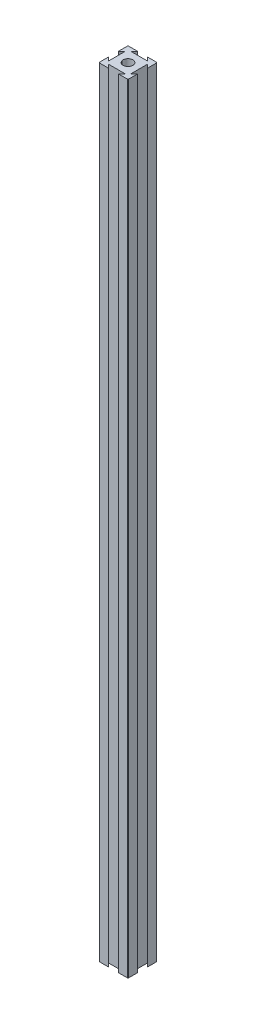
ISO-10303-21;
HEADER;
FILE_DESCRIPTION(('STEP AP214'),'2;1');
FILE_NAME('part.step','',(''),(''),'','','');
FILE_SCHEMA(('AUTOMOTIVE_DESIGN { 1 0 10303 214 1 1 1 1 }'));
ENDSEC;
DATA;
#1=APPLICATION_CONTEXT('core data for automotive mechanical design processes');
#2=APPLICATION_PROTOCOL_DEFINITION('international standard','automotive_design',2000,#1);
#3=PRODUCT_CONTEXT('',#1,'mechanical');
#4=PRODUCT('Part','Part','',(#3));
#5=PRODUCT_RELATED_PRODUCT_CATEGORY('part','',(#4));
#6=PRODUCT_DEFINITION_FORMATION('','',#4);
#7=PRODUCT_DEFINITION_CONTEXT('part definition',#1,'design');
#8=PRODUCT_DEFINITION('design','',#6,#7);
#9=PRODUCT_DEFINITION_SHAPE('','',#8);
#10=(LENGTH_UNIT() NAMED_UNIT(*) SI_UNIT(.MILLI.,.METRE.));
#11=(NAMED_UNIT(*) PLANE_ANGLE_UNIT() SI_UNIT($,.RADIAN.));
#12=(NAMED_UNIT(*) SI_UNIT($,.STERADIAN.) SOLID_ANGLE_UNIT());
#13=UNCERTAINTY_MEASURE_WITH_UNIT(LENGTH_MEASURE(1.E-05),#10,'distance_accuracy_value','');
#14=(GEOMETRIC_REPRESENTATION_CONTEXT(3) GLOBAL_UNCERTAINTY_ASSIGNED_CONTEXT((#13)) GLOBAL_UNIT_ASSIGNED_CONTEXT((#10,
#11,#12)) REPRESENTATION_CONTEXT('',''));
#15=CARTESIAN_POINT('',(0.,0.,0.));
#16=DIRECTION('',(0.,0.,1.));
#17=DIRECTION('',(1.,0.,0.));
#18=AXIS2_PLACEMENT_3D('',#15,#16,#17);
#19=CARTESIAN_POINT('',(16.6666666666667,533.4,-16.6666666666667));
#20=DIRECTION('',(-0.707106781186547,0.,0.707106781186548));
#21=DIRECTION('',(0.707106781186548,0.,0.707106781186547));
#22=AXIS2_PLACEMENT_3D('',#19,#20,#21);
#23=PLANE('',#22);
#24=DIRECTION('',(-0.707106781186548,0.,-0.707106781186547));
#25=VECTOR('',#24,1.);
#26=CARTESIAN_POINT('',(16.6666666666667,0.,-16.6666666666667));
#27=LINE('',#26,#25);
#28=CARTESIAN_POINT('',(20.,0.,-13.3333333333333));
#29=VERTEX_POINT('',#28);
#30=CARTESIAN_POINT('',(17.6183333333333,0.,-15.715));
#31=VERTEX_POINT('',#30);
#32=EDGE_CURVE('E201',#29,#31,#27,.T.);
#33=ORIENTED_EDGE('',*,*,#32,.F.);
#34=DIRECTION('',(0.,-1.,0.));
#35=VECTOR('',#34,1.);
#36=CARTESIAN_POINT('',(20.,533.4,-13.3333333333333));
#37=LINE('',#36,#35);
#38=CARTESIAN_POINT('',(20.,533.4,-13.3333333333333));
#39=VERTEX_POINT('',#38);
#40=EDGE_CURVE('E195',#39,#29,#37,.T.);
#41=ORIENTED_EDGE('',*,*,#40,.F.);
#42=DIRECTION('',(-0.707106781186548,0.,-0.707106781186547));
#43=VECTOR('',#42,1.);
#44=CARTESIAN_POINT('',(16.6666666666667,533.4,-16.6666666666667));
#45=LINE('',#44,#43);
#46=CARTESIAN_POINT('',(17.6183333333333,533.4,-15.715));
#47=VERTEX_POINT('',#46);
#48=EDGE_CURVE('E198',#39,#47,#45,.T.);
#49=ORIENTED_EDGE('',*,*,#48,.T.);
#50=DIRECTION('',(0.,-1.,0.));
#51=VECTOR('',#50,1.);
#52=CARTESIAN_POINT('',(17.6183333333333,533.4,-15.715));
#53=LINE('',#52,#51);
#54=EDGE_CURVE('E269',#47,#31,#53,.T.);
#55=ORIENTED_EDGE('',*,*,#54,.T.);
#56=EDGE_LOOP('',(#33,#41,#49,#55));
#57=FACE_BOUND('',#56,.T.);
#58=ADVANCED_FACE('F35',(#57),#23,.T.);
#59=CARTESIAN_POINT('',(20.,533.4,0.));
#60=DIRECTION('',(-1.,0.,0.));
#61=DIRECTION('',(0.,0.,1.));
#62=AXIS2_PLACEMENT_3D('',#59,#60,#61);
#63=PLANE('',#62);
#64=DIRECTION('',(0.,0.,-1.));
#65=VECTOR('',#64,1.);
#66=CARTESIAN_POINT('',(20.,0.,0.));
#67=LINE('',#66,#65);
#68=CARTESIAN_POINT('',(20.,0.,-19.492));
#69=VERTEX_POINT('',#68);
#70=EDGE_CURVE('E274',#29,#69,#67,.T.);
#71=ORIENTED_EDGE('',*,*,#70,.T.);
#72=DIRECTION('',(0.,-1.,0.));
#73=VECTOR('',#72,1.);
#74=CARTESIAN_POINT('',(20.,533.4,-19.492));
#75=LINE('',#74,#73);
#76=CARTESIAN_POINT('',(20.,533.4,-19.492));
#77=VERTEX_POINT('',#76);
#78=EDGE_CURVE('E212',#69,#77,#75,.F.);
#79=ORIENTED_EDGE('',*,*,#78,.T.);
#80=DIRECTION('',(0.,0.,-1.));
#81=VECTOR('',#80,1.);
#82=CARTESIAN_POINT('',(20.,533.4,0.));
#83=LINE('',#82,#81);
#84=EDGE_CURVE('E209',#39,#77,#83,.T.);
#85=ORIENTED_EDGE('',*,*,#84,.F.);
#86=ORIENTED_EDGE('',*,*,#40,.T.);
#87=EDGE_LOOP('',(#71,#79,#85,#86));
#88=FACE_BOUND('',#87,.T.);
#89=ADVANCED_FACE('F210',(#88),#63,.F.);
#90=CARTESIAN_POINT('',(0.,533.4,-20.));
#91=DIRECTION('',(0.,0.,-1.));
#92=DIRECTION('',(-1.,0.,0.));
#93=AXIS2_PLACEMENT_3D('',#90,#91,#92);
#94=PLANE('',#93);
#95=DIRECTION('',(1.,0.,0.));
#96=VECTOR('',#95,1.);
#97=CARTESIAN_POINT('',(0.,533.4,-20.));
#98=LINE('',#97,#96);
#99=CARTESIAN_POINT('',(13.3333333333333,533.4,-20.));
#100=VERTEX_POINT('',#99);
#101=CARTESIAN_POINT('',(19.492,533.4,-20.));
#102=VERTEX_POINT('',#101);
#103=EDGE_CURVE('E214',#100,#102,#98,.T.);
#104=ORIENTED_EDGE('',*,*,#103,.T.);
#105=DIRECTION('',(0.,-1.,0.));
#106=VECTOR('',#105,1.);
#107=CARTESIAN_POINT('',(19.492,0.,-20.));
#108=LINE('',#107,#106);
#109=CARTESIAN_POINT('',(19.492,0.,-20.));
#110=VERTEX_POINT('',#109);
#111=EDGE_CURVE('E376',#102,#110,#108,.T.);
#112=ORIENTED_EDGE('',*,*,#111,.T.);
#113=DIRECTION('',(1.,0.,0.));
#114=VECTOR('',#113,1.);
#115=CARTESIAN_POINT('',(0.,0.,-20.));
#116=LINE('',#115,#114);
#117=CARTESIAN_POINT('',(13.3333333333333,0.,-20.));
#118=VERTEX_POINT('',#117);
#119=EDGE_CURVE('E276',#118,#110,#116,.T.);
#120=ORIENTED_EDGE('',*,*,#119,.F.);
#121=DIRECTION('',(0.,-1.,0.));
#122=VECTOR('',#121,1.);
#123=CARTESIAN_POINT('',(13.3333333333333,533.4,-20.));
#124=LINE('',#123,#122);
#125=EDGE_CURVE('E206',#100,#118,#124,.T.);
#126=ORIENTED_EDGE('',*,*,#125,.F.);
#127=EDGE_LOOP('',(#104,#112,#120,#126));
#128=FACE_BOUND('',#127,.T.);
#129=ADVANCED_FACE('F408',(#128),#94,.T.);
#130=CARTESIAN_POINT('',(16.6666666666666,533.4,-16.6666666666668));
#131=DIRECTION('',(-0.707106781186544,0.,0.707106781186551));
#132=DIRECTION('',(0.707106781186551,0.,0.707106781186544));
#133=AXIS2_PLACEMENT_3D('',#130,#131,#132);
#134=PLANE('',#133);
#135=DIRECTION('',(-0.707106781186551,0.,-0.707106781186544));
#136=VECTOR('',#135,1.);
#137=CARTESIAN_POINT('',(16.6666666666666,0.,-16.6666666666668));
#138=LINE('',#137,#136);
#139=CARTESIAN_POINT('',(15.715,0.,-17.6183333333334));
#140=VERTEX_POINT('',#139);
#141=EDGE_CURVE('E280',#140,#118,#138,.T.);
#142=ORIENTED_EDGE('',*,*,#141,.F.);
#143=DIRECTION('',(0.,-1.,0.));
#144=VECTOR('',#143,1.);
#145=CARTESIAN_POINT('',(15.715,533.4,-17.6183333333334));
#146=LINE('',#145,#144);
#147=CARTESIAN_POINT('',(15.715,533.4,-17.6183333333334));
#148=VERTEX_POINT('',#147);
#149=EDGE_CURVE('E354',#148,#140,#146,.T.);
#150=ORIENTED_EDGE('',*,*,#149,.F.);
#151=DIRECTION('',(-0.707106781186551,0.,-0.707106781186544));
#152=VECTOR('',#151,1.);
#153=CARTESIAN_POINT('',(16.6666666666666,533.4,-16.6666666666668));
#154=LINE('',#153,#152);
#155=EDGE_CURVE('E230',#148,#100,#154,.T.);
#156=ORIENTED_EDGE('',*,*,#155,.T.);
#157=ORIENTED_EDGE('',*,*,#125,.T.);
#158=EDGE_LOOP('',(#142,#150,#156,#157));
#159=FACE_BOUND('',#158,.T.);
#160=ADVANCED_FACE('F412',(#159),#134,.T.);
#161=CARTESIAN_POINT('',(0.,533.4,-17.6183333333334));
#162=DIRECTION('',(0.,0.,-1.));
#163=DIRECTION('',(-1.,0.,0.));
#164=AXIS2_PLACEMENT_3D('',#161,#162,#163);
#165=PLANE('',#164);
#166=DIRECTION('',(1.,0.,0.));
#167=VECTOR('',#166,1.);
#168=CARTESIAN_POINT('',(0.,0.,-17.6183333333334));
#169=LINE('',#168,#167);
#170=CARTESIAN_POINT('',(4.285,0.,-17.6183333333334));
#171=VERTEX_POINT('',#170);
#172=EDGE_CURVE('E284',#171,#140,#169,.T.);
#173=ORIENTED_EDGE('',*,*,#172,.F.);
#174=DIRECTION('',(0.,-1.,0.));
#175=VECTOR('',#174,1.);
#176=CARTESIAN_POINT('',(4.285,533.4,-17.6183333333334));
#177=LINE('',#176,#175);
#178=CARTESIAN_POINT('',(4.285,533.4,-17.6183333333334));
#179=VERTEX_POINT('',#178);
#180=EDGE_CURVE('E352',#179,#171,#177,.T.);
#181=ORIENTED_EDGE('',*,*,#180,.F.);
#182=DIRECTION('',(1.,0.,0.));
#183=VECTOR('',#182,1.);
#184=CARTESIAN_POINT('',(0.,533.4,-17.6183333333334));
#185=LINE('',#184,#183);
#186=EDGE_CURVE('E234',#179,#148,#185,.T.);
#187=ORIENTED_EDGE('',*,*,#186,.T.);
#188=ORIENTED_EDGE('',*,*,#149,.T.);
#189=EDGE_LOOP('',(#173,#181,#187,#188));
#190=FACE_BOUND('',#189,.T.);
#191=ADVANCED_FACE('F439',(#190),#165,.T.);
#192=CARTESIAN_POINT('',(-6.6666666666667,533.4,-6.66666666666677));
#193=DIRECTION('',(0.707106781186544,0.,0.707106781186551));
#194=DIRECTION('',(0.707106781186551,0.,-0.707106781186544));
#195=AXIS2_PLACEMENT_3D('',#192,#193,#194);
#196=PLANE('',#195);
#197=DIRECTION('',(-0.707106781186551,0.,0.707106781186544));
#198=VECTOR('',#197,1.);
#199=CARTESIAN_POINT('',(-6.6666666666667,0.,-6.66666666666677));
#200=LINE('',#199,#198);
#201=CARTESIAN_POINT('',(6.66666666666666,0.,-20.));
#202=VERTEX_POINT('',#201);
#203=EDGE_CURVE('E287',#202,#171,#200,.T.);
#204=ORIENTED_EDGE('',*,*,#203,.F.);
#205=DIRECTION('',(0.,-1.,0.));
#206=VECTOR('',#205,1.);
#207=CARTESIAN_POINT('',(6.66666666666666,533.4,-20.));
#208=LINE('',#207,#206);
#209=CARTESIAN_POINT('',(6.66666666666666,533.4,-20.));
#210=VERTEX_POINT('',#209);
#211=EDGE_CURVE('E349',#210,#202,#208,.T.);
#212=ORIENTED_EDGE('',*,*,#211,.F.);
#213=DIRECTION('',(-0.707106781186551,0.,0.707106781186544));
#214=VECTOR('',#213,1.);
#215=CARTESIAN_POINT('',(-6.6666666666667,533.4,-6.66666666666677));
#216=LINE('',#215,#214);
#217=EDGE_CURVE('E237',#210,#179,#216,.T.);
#218=ORIENTED_EDGE('',*,*,#217,.T.);
#219=ORIENTED_EDGE('',*,*,#180,.T.);
#220=EDGE_LOOP('',(#204,#212,#218,#219));
#221=FACE_BOUND('',#220,.T.);
#222=ADVANCED_FACE('F442',(#221),#196,.T.);
#223=CARTESIAN_POINT('',(0.508,0.,-20.));
#224=VERTEX_POINT('',#223);
#225=EDGE_CURVE('E281',#224,#202,#116,.T.);
#226=ORIENTED_EDGE('',*,*,#225,.F.);
#227=DIRECTION('',(0.,-1.,0.));
#228=VECTOR('',#227,1.);
#229=CARTESIAN_POINT('',(0.508,533.4,-20.));
#230=LINE('',#229,#228);
#231=CARTESIAN_POINT('',(0.508,533.4,-20.));
#232=VERTEX_POINT('',#231);
#233=EDGE_CURVE('E367',#224,#232,#230,.F.);
#234=ORIENTED_EDGE('',*,*,#233,.T.);
#235=EDGE_CURVE('E231',#232,#210,#98,.T.);
#236=ORIENTED_EDGE('',*,*,#235,.T.);
#237=ORIENTED_EDGE('',*,*,#211,.T.);
#238=EDGE_LOOP('',(#226,#234,#236,#237));
#239=FACE_BOUND('',#238,.T.);
#240=ADVANCED_FACE('F505',(#239),#94,.T.);
#241=CARTESIAN_POINT('',(0.,533.4,0.));
#242=DIRECTION('',(-1.,0.,0.));
#243=DIRECTION('',(0.,0.,1.));
#244=AXIS2_PLACEMENT_3D('',#241,#242,#243);
#245=PLANE('',#244);
#246=DIRECTION('',(0.,0.,-1.));
#247=VECTOR('',#246,1.);
#248=CARTESIAN_POINT('',(0.,533.4,0.));
#249=LINE('',#248,#247);
#250=CARTESIAN_POINT('',(0.,533.4,-13.3333333333333));
#251=VERTEX_POINT('',#250);
#252=CARTESIAN_POINT('',(0.,533.4,-19.492));
#253=VERTEX_POINT('',#252);
#254=EDGE_CURVE('E240',#251,#253,#249,.T.);
#255=ORIENTED_EDGE('',*,*,#254,.T.);
#256=DIRECTION('',(0.,-1.,0.));
#257=VECTOR('',#256,1.);
#258=CARTESIAN_POINT('',(0.,533.4,-19.492));
#259=LINE('',#258,#257);
#260=CARTESIAN_POINT('',(0.,0.,-19.492));
#261=VERTEX_POINT('',#260);
#262=EDGE_CURVE('E205',#253,#261,#259,.T.);
#263=ORIENTED_EDGE('',*,*,#262,.T.);
#264=DIRECTION('',(0.,0.,-1.));
#265=VECTOR('',#264,1.);
#266=CARTESIAN_POINT('',(0.,0.,0.));
#267=LINE('',#266,#265);
#268=CARTESIAN_POINT('',(0.,0.,-13.3333333333333));
#269=VERTEX_POINT('',#268);
#270=EDGE_CURVE('E290',#269,#261,#267,.T.);
#271=ORIENTED_EDGE('',*,*,#270,.F.);
#272=DIRECTION('',(0.,-1.,0.));
#273=VECTOR('',#272,1.);
#274=CARTESIAN_POINT('',(0.,533.4,-13.3333333333333));
#275=LINE('',#274,#273);
#276=EDGE_CURVE('E347',#251,#269,#275,.T.);
#277=ORIENTED_EDGE('',*,*,#276,.F.);
#278=EDGE_LOOP('',(#255,#263,#271,#277));
#279=FACE_BOUND('',#278,.T.);
#280=ADVANCED_FACE('F451',(#279),#245,.T.);
#281=CARTESIAN_POINT('',(-6.66666666666667,533.4,-6.66666666666669));
#282=DIRECTION('',(-0.707106781186547,0.,-0.707106781186549));
#283=DIRECTION('',(-0.707106781186549,0.,0.707106781186547));
#284=AXIS2_PLACEMENT_3D('',#281,#282,#283);
#285=PLANE('',#284);
#286=DIRECTION('',(0.707106781186549,0.,-0.707106781186547));
#287=VECTOR('',#286,1.);
#288=CARTESIAN_POINT('',(-6.66666666666667,0.,-6.66666666666669));
#289=LINE('',#288,#287);
#290=CARTESIAN_POINT('',(2.38166666666667,0.,-15.715));
#291=VERTEX_POINT('',#290);
#292=EDGE_CURVE('E293',#269,#291,#289,.T.);
#293=ORIENTED_EDGE('',*,*,#292,.T.);
#294=DIRECTION('',(0.,-1.,0.));
#295=VECTOR('',#294,1.);
#296=CARTESIAN_POINT('',(2.38166666666667,533.4,-15.715));
#297=LINE('',#296,#295);
#298=CARTESIAN_POINT('',(2.38166666666667,533.4,-15.715));
#299=VERTEX_POINT('',#298);
#300=EDGE_CURVE('E344',#299,#291,#297,.T.);
#301=ORIENTED_EDGE('',*,*,#300,.F.);
#302=DIRECTION('',(0.707106781186549,0.,-0.707106781186547));
#303=VECTOR('',#302,1.);
#304=CARTESIAN_POINT('',(-6.66666666666667,533.4,-6.66666666666669));
#305=LINE('',#304,#303);
#306=EDGE_CURVE('E243',#251,#299,#305,.T.);
#307=ORIENTED_EDGE('',*,*,#306,.F.);
#308=ORIENTED_EDGE('',*,*,#276,.T.);
#309=EDGE_LOOP('',(#293,#301,#307,#308));
#310=FACE_BOUND('',#309,.T.);
#311=ADVANCED_FACE('F456',(#310),#285,.F.);
#312=CARTESIAN_POINT('',(2.38166666666667,533.4,0.));
#313=DIRECTION('',(1.,0.,0.));
#314=DIRECTION('',(0.,0.,-1.));
#315=AXIS2_PLACEMENT_3D('',#312,#313,#314);
#316=PLANE('',#315);
#317=DIRECTION('',(0.,0.,1.));
#318=VECTOR('',#317,1.);
#319=CARTESIAN_POINT('',(2.38166666666667,0.,0.));
#320=LINE('',#319,#318);
#321=CARTESIAN_POINT('',(2.38166666666667,0.,-4.285));
#322=VERTEX_POINT('',#321);
#323=EDGE_CURVE('E297',#291,#322,#320,.T.);
#324=ORIENTED_EDGE('',*,*,#323,.T.);
#325=DIRECTION('',(0.,-1.,0.));
#326=VECTOR('',#325,1.);
#327=CARTESIAN_POINT('',(2.38166666666667,533.4,-4.285));
#328=LINE('',#327,#326);
#329=CARTESIAN_POINT('',(2.38166666666667,533.4,-4.285));
#330=VERTEX_POINT('',#329);
#331=EDGE_CURVE('E341',#330,#322,#328,.T.);
#332=ORIENTED_EDGE('',*,*,#331,.F.);
#333=DIRECTION('',(0.,0.,1.));
#334=VECTOR('',#333,1.);
#335=CARTESIAN_POINT('',(2.38166666666667,533.4,0.));
#336=LINE('',#335,#334);
#337=EDGE_CURVE('E247',#299,#330,#336,.T.);
#338=ORIENTED_EDGE('',*,*,#337,.F.);
#339=ORIENTED_EDGE('',*,*,#300,.T.);
#340=EDGE_LOOP('',(#324,#332,#338,#339));
#341=FACE_BOUND('',#340,.T.);
#342=ADVANCED_FACE('F462',(#341),#316,.F.);
#343=CARTESIAN_POINT('',(3.33333333333333,533.4,-3.33333333333335));
#344=DIRECTION('',(-0.707106781186546,0.,0.707106781186549));
#345=DIRECTION('',(0.707106781186549,0.,0.707106781186546));
#346=AXIS2_PLACEMENT_3D('',#343,#344,#345);
#347=PLANE('',#346);
#348=DIRECTION('',(-0.707106781186549,0.,-0.707106781186546));
#349=VECTOR('',#348,1.);
#350=CARTESIAN_POINT('',(3.33333333333333,0.,-3.33333333333335));
#351=LINE('',#350,#349);
#352=CARTESIAN_POINT('',(0.,0.,-6.66666666666667));
#353=VERTEX_POINT('',#352);
#354=EDGE_CURVE('E300',#322,#353,#351,.T.);
#355=ORIENTED_EDGE('',*,*,#354,.T.);
#356=DIRECTION('',(0.,-1.,0.));
#357=VECTOR('',#356,1.);
#358=CARTESIAN_POINT('',(0.,533.4,-6.66666666666667));
#359=LINE('',#358,#357);
#360=CARTESIAN_POINT('',(0.,533.4,-6.66666666666667));
#361=VERTEX_POINT('',#360);
#362=EDGE_CURVE('E338',#361,#353,#359,.T.);
#363=ORIENTED_EDGE('',*,*,#362,.F.);
#364=DIRECTION('',(-0.707106781186549,0.,-0.707106781186546));
#365=VECTOR('',#364,1.);
#366=CARTESIAN_POINT('',(3.33333333333333,533.4,-3.33333333333335));
#367=LINE('',#366,#365);
#368=EDGE_CURVE('E250',#330,#361,#367,.T.);
#369=ORIENTED_EDGE('',*,*,#368,.F.);
#370=ORIENTED_EDGE('',*,*,#331,.T.);
#371=EDGE_LOOP('',(#355,#363,#369,#370));
#372=FACE_BOUND('',#371,.T.);
#373=ADVANCED_FACE('F464',(#372),#347,.F.);
#374=CARTESIAN_POINT('',(0.,0.,-0.508));
#375=VERTEX_POINT('',#374);
#376=EDGE_CURVE('E294',#375,#353,#267,.T.);
#377=ORIENTED_EDGE('',*,*,#376,.F.);
#378=DIRECTION('',(0.,-1.,0.));
#379=VECTOR('',#378,1.);
#380=CARTESIAN_POINT('',(0.,533.4,-0.508));
#381=LINE('',#380,#379);
#382=CARTESIAN_POINT('',(0.,533.4,-0.508));
#383=VERTEX_POINT('',#382);
#384=EDGE_CURVE('E383',#375,#383,#381,.F.);
#385=ORIENTED_EDGE('',*,*,#384,.T.);
#386=EDGE_CURVE('E244',#383,#361,#249,.T.);
#387=ORIENTED_EDGE('',*,*,#386,.T.);
#388=ORIENTED_EDGE('',*,*,#362,.T.);
#389=EDGE_LOOP('',(#377,#385,#387,#388));
#390=FACE_BOUND('',#389,.T.);
#391=ADVANCED_FACE('F467',(#390),#245,.T.);
#392=CARTESIAN_POINT('',(0.,533.4,0.));
#393=DIRECTION('',(0.,0.,-1.));
#394=DIRECTION('',(-1.,0.,0.));
#395=AXIS2_PLACEMENT_3D('',#392,#393,#394);
#396=PLANE('',#395);
#397=DIRECTION('',(1.,0.,0.));
#398=VECTOR('',#397,1.);
#399=CARTESIAN_POINT('',(0.,533.4,0.));
#400=LINE('',#399,#398);
#401=CARTESIAN_POINT('',(0.508,533.4,0.));
#402=VERTEX_POINT('',#401);
#403=CARTESIAN_POINT('',(6.66666666666667,533.4,0.));
#404=VERTEX_POINT('',#403);
#405=EDGE_CURVE('E253',#402,#404,#400,.T.);
#406=ORIENTED_EDGE('',*,*,#405,.F.);
#407=DIRECTION('',(0.,-1.,0.));
#408=VECTOR('',#407,1.);
#409=CARTESIAN_POINT('',(0.508,0.,0.));
#410=LINE('',#409,#408);
#411=CARTESIAN_POINT('',(0.508,0.,0.));
#412=VERTEX_POINT('',#411);
#413=EDGE_CURVE('E380',#402,#412,#410,.T.);
#414=ORIENTED_EDGE('',*,*,#413,.T.);
#415=DIRECTION('',(1.,0.,0.));
#416=VECTOR('',#415,1.);
#417=CARTESIAN_POINT('',(0.,0.,0.));
#418=LINE('',#417,#416);
#419=CARTESIAN_POINT('',(6.66666666666667,0.,0.));
#420=VERTEX_POINT('',#419);
#421=EDGE_CURVE('E303',#412,#420,#418,.T.);
#422=ORIENTED_EDGE('',*,*,#421,.T.);
#423=DIRECTION('',(0.,-1.,0.));
#424=VECTOR('',#423,1.);
#425=CARTESIAN_POINT('',(6.66666666666667,533.4,0.));
#426=LINE('',#425,#424);
#427=EDGE_CURVE('E335',#404,#420,#426,.T.);
#428=ORIENTED_EDGE('',*,*,#427,.F.);
#429=EDGE_LOOP('',(#406,#414,#422,#428));
#430=FACE_BOUND('',#429,.T.);
#431=ADVANCED_FACE('F474',(#430),#396,.F.);
#432=CARTESIAN_POINT('',(3.3333333333333,533.4,-3.33333333333333));
#433=DIRECTION('',(-0.707106781186544,0.,0.707106781186551));
#434=DIRECTION('',(0.707106781186551,0.,0.707106781186544));
#435=AXIS2_PLACEMENT_3D('',#432,#433,#434);
#436=PLANE('',#435);
#437=DIRECTION('',(-0.707106781186551,0.,-0.707106781186544));
#438=VECTOR('',#437,1.);
#439=CARTESIAN_POINT('',(3.3333333333333,0.,-3.33333333333333));
#440=LINE('',#439,#438);
#441=CARTESIAN_POINT('',(4.285,0.,-2.38166666666664));
#442=VERTEX_POINT('',#441);
#443=EDGE_CURVE('E305',#420,#442,#440,.T.);
#444=ORIENTED_EDGE('',*,*,#443,.T.);
#445=DIRECTION('',(0.,-1.,0.));
#446=VECTOR('',#445,1.);
#447=CARTESIAN_POINT('',(4.285,533.4,-2.38166666666664));
#448=LINE('',#447,#446);
#449=CARTESIAN_POINT('',(4.285,533.4,-2.38166666666664));
#450=VERTEX_POINT('',#449);
#451=EDGE_CURVE('E332',#450,#442,#448,.T.);
#452=ORIENTED_EDGE('',*,*,#451,.F.);
#453=DIRECTION('',(-0.707106781186551,0.,-0.707106781186544));
#454=VECTOR('',#453,1.);
#455=CARTESIAN_POINT('',(3.3333333333333,533.4,-3.33333333333333));
#456=LINE('',#455,#454);
#457=EDGE_CURVE('E255',#404,#450,#456,.T.);
#458=ORIENTED_EDGE('',*,*,#457,.F.);
#459=ORIENTED_EDGE('',*,*,#427,.T.);
#460=EDGE_LOOP('',(#444,#452,#458,#459));
#461=FACE_BOUND('',#460,.T.);
#462=ADVANCED_FACE('F480',(#461),#436,.F.);
#463=CARTESIAN_POINT('',(0.,533.4,-2.38166666666664));
#464=DIRECTION('',(0.,0.,-1.));
#465=DIRECTION('',(-1.,0.,0.));
#466=AXIS2_PLACEMENT_3D('',#463,#464,#465);
#467=PLANE('',#466);
#468=DIRECTION('',(1.,0.,0.));
#469=VECTOR('',#468,1.);
#470=CARTESIAN_POINT('',(0.,0.,-2.38166666666664));
#471=LINE('',#470,#469);
#472=CARTESIAN_POINT('',(15.715,0.,-2.38166666666664));
#473=VERTEX_POINT('',#472);
#474=EDGE_CURVE('E309',#442,#473,#471,.T.);
#475=ORIENTED_EDGE('',*,*,#474,.T.);
#476=DIRECTION('',(0.,-1.,0.));
#477=VECTOR('',#476,1.);
#478=CARTESIAN_POINT('',(15.715,533.4,-2.38166666666664));
#479=LINE('',#478,#477);
#480=CARTESIAN_POINT('',(15.715,533.4,-2.38166666666664));
#481=VERTEX_POINT('',#480);
#482=EDGE_CURVE('E329',#481,#473,#479,.T.);
#483=ORIENTED_EDGE('',*,*,#482,.F.);
#484=DIRECTION('',(1.,0.,0.));
#485=VECTOR('',#484,1.);
#486=CARTESIAN_POINT('',(0.,533.4,-2.38166666666664));
#487=LINE('',#486,#485);
#488=EDGE_CURVE('E259',#450,#481,#487,.T.);
#489=ORIENTED_EDGE('',*,*,#488,.F.);
#490=ORIENTED_EDGE('',*,*,#451,.T.);
#491=EDGE_LOOP('',(#475,#483,#489,#490));
#492=FACE_BOUND('',#491,.T.);
#493=ADVANCED_FACE('F483',(#492),#467,.F.);
#494=CARTESIAN_POINT('',(6.66666666666659,533.4,6.66666666666667));
#495=DIRECTION('',(0.707106781186544,0.,0.707106781186551));
#496=DIRECTION('',(0.707106781186551,0.,-0.707106781186544));
#497=AXIS2_PLACEMENT_3D('',#494,#495,#496);
#498=PLANE('',#497);
#499=DIRECTION('',(-0.707106781186551,0.,0.707106781186544));
#500=VECTOR('',#499,1.);
#501=CARTESIAN_POINT('',(6.66666666666659,0.,6.66666666666667));
#502=LINE('',#501,#500);
#503=CARTESIAN_POINT('',(13.3333333333333,0.,0.));
#504=VERTEX_POINT('',#503);
#505=EDGE_CURVE('E312',#473,#504,#502,.T.);
#506=ORIENTED_EDGE('',*,*,#505,.T.);
#507=DIRECTION('',(0.,-1.,0.));
#508=VECTOR('',#507,1.);
#509=CARTESIAN_POINT('',(13.3333333333333,533.4,0.));
#510=LINE('',#509,#508);
#511=CARTESIAN_POINT('',(13.3333333333333,533.4,0.));
#512=VERTEX_POINT('',#511);
#513=EDGE_CURVE('E326',#512,#504,#510,.T.);
#514=ORIENTED_EDGE('',*,*,#513,.F.);
#515=DIRECTION('',(-0.707106781186551,0.,0.707106781186544));
#516=VECTOR('',#515,1.);
#517=CARTESIAN_POINT('',(6.66666666666659,533.4,6.66666666666667));
#518=LINE('',#517,#516);
#519=EDGE_CURVE('E262',#481,#512,#518,.T.);
#520=ORIENTED_EDGE('',*,*,#519,.F.);
#521=ORIENTED_EDGE('',*,*,#482,.T.);
#522=EDGE_LOOP('',(#506,#514,#520,#521));
#523=FACE_BOUND('',#522,.T.);
#524=ADVANCED_FACE('F485',(#523),#498,.F.);
#525=CARTESIAN_POINT('',(19.492,0.,0.));
#526=VERTEX_POINT('',#525);
#527=EDGE_CURVE('E306',#504,#526,#418,.T.);
#528=ORIENTED_EDGE('',*,*,#527,.T.);
#529=DIRECTION('',(0.,-1.,0.));
#530=VECTOR('',#529,1.);
#531=CARTESIAN_POINT('',(19.492,533.4,0.));
#532=LINE('',#531,#530);
#533=CARTESIAN_POINT('',(19.492,533.4,0.));
#534=VERTEX_POINT('',#533);
#535=EDGE_CURVE('E11',#526,#534,#532,.F.);
#536=ORIENTED_EDGE('',*,*,#535,.T.);
#537=EDGE_CURVE('E256',#512,#534,#400,.T.);
#538=ORIENTED_EDGE('',*,*,#537,.F.);
#539=ORIENTED_EDGE('',*,*,#513,.T.);
#540=EDGE_LOOP('',(#528,#536,#538,#539));
#541=FACE_BOUND('',#540,.T.);
#542=ADVANCED_FACE('F394',(#541),#396,.F.);
#543=CARTESIAN_POINT('',(20.,533.4,-0.508));
#544=VERTEX_POINT('',#543);
#545=CARTESIAN_POINT('',(20.,533.4,-6.66666666666667));
#546=VERTEX_POINT('',#545);
#547=EDGE_CURVE('E216',#544,#546,#83,.T.);
#548=ORIENTED_EDGE('',*,*,#547,.F.);
#549=DIRECTION('',(0.,-1.,0.));
#550=VECTOR('',#549,1.);
#551=CARTESIAN_POINT('',(20.,533.4,-0.508));
#552=LINE('',#551,#550);
#553=CARTESIAN_POINT('',(20.,0.,-0.508));
#554=VERTEX_POINT('',#553);
#555=EDGE_CURVE('E43',#544,#554,#552,.T.);
#556=ORIENTED_EDGE('',*,*,#555,.T.);
#557=CARTESIAN_POINT('',(20.,0.,-6.66666666666667));
#558=VERTEX_POINT('',#557);
#559=EDGE_CURVE('E277',#554,#558,#67,.T.);
#560=ORIENTED_EDGE('',*,*,#559,.T.);
#561=DIRECTION('',(0.,-1.,0.));
#562=VECTOR('',#561,1.);
#563=CARTESIAN_POINT('',(20.,533.4,-6.66666666666667));
#564=LINE('',#563,#562);
#565=EDGE_CURVE('E323',#546,#558,#564,.T.);
#566=ORIENTED_EDGE('',*,*,#565,.F.);
#567=EDGE_LOOP('',(#548,#556,#560,#566));
#568=FACE_BOUND('',#567,.T.);
#569=ADVANCED_FACE('F388',(#568),#63,.F.);
#570=CARTESIAN_POINT('',(6.66666666666663,533.4,6.66666666666666));
#571=DIRECTION('',(-0.707106781186546,0.,-0.707106781186549));
#572=DIRECTION('',(-0.707106781186549,0.,0.707106781186546));
#573=AXIS2_PLACEMENT_3D('',#570,#571,#572);
#574=PLANE('',#573);
#575=DIRECTION('',(0.707106781186549,0.,-0.707106781186546));
#576=VECTOR('',#575,1.);
#577=CARTESIAN_POINT('',(6.66666666666663,0.,6.66666666666666));
#578=LINE('',#577,#576);
#579=CARTESIAN_POINT('',(17.6183333333333,0.,-4.285));
#580=VERTEX_POINT('',#579);
#581=EDGE_CURVE('E315',#580,#558,#578,.T.);
#582=ORIENTED_EDGE('',*,*,#581,.F.);
#583=DIRECTION('',(0.,-1.,0.));
#584=VECTOR('',#583,1.);
#585=CARTESIAN_POINT('',(17.6183333333333,533.4,-4.285));
#586=LINE('',#585,#584);
#587=CARTESIAN_POINT('',(17.6183333333333,533.4,-4.285));
#588=VERTEX_POINT('',#587);
#589=EDGE_CURVE('E321',#588,#580,#586,.T.);
#590=ORIENTED_EDGE('',*,*,#589,.F.);
#591=DIRECTION('',(0.707106781186549,0.,-0.707106781186546));
#592=VECTOR('',#591,1.);
#593=CARTESIAN_POINT('',(6.66666666666663,533.4,6.66666666666666));
#594=LINE('',#593,#592);
#595=EDGE_CURVE('E265',#588,#546,#594,.T.);
#596=ORIENTED_EDGE('',*,*,#595,.T.);
#597=ORIENTED_EDGE('',*,*,#565,.T.);
#598=EDGE_LOOP('',(#582,#590,#596,#597));
#599=FACE_BOUND('',#598,.T.);
#600=ADVANCED_FACE('F418',(#599),#574,.T.);
#601=CARTESIAN_POINT('',(10.,533.4,-10.));
#602=DIRECTION('',(0.,-1.,0.));
#603=DIRECTION('',(0.,0.,-1.));
#604=AXIS2_PLACEMENT_3D('',#601,#602,#603);
#605=CYLINDRICAL_SURFACE('',#604,3.33333333333333);
#606=CARTESIAN_POINT('',(10.,533.4,-10.));
#607=DIRECTION('',(0.,1.,0.));
#608=DIRECTION('',(0.,0.,1.));
#609=AXIS2_PLACEMENT_3D('',#606,#607,#608);
#610=CIRCLE('',#609,3.33333333333333);
#611=CARTESIAN_POINT('',(10.,533.4,-6.66666666666667));
#612=VERTEX_POINT('',#611);
#613=EDGE_CURVE('E222',#612,#612,#610,.T.);
#614=ORIENTED_EDGE('',*,*,#613,.T.);
#615=EDGE_LOOP('',(#614));
#616=FACE_BOUND('',#615,.T.);
#617=CARTESIAN_POINT('',(10.,0.,-10.));
#618=DIRECTION('',(0.,1.,0.));
#619=DIRECTION('',(0.,0.,1.));
#620=AXIS2_PLACEMENT_3D('',#617,#618,#619);
#621=CIRCLE('',#620,3.33333333333333);
#622=CARTESIAN_POINT('',(10.,0.,-6.66666666666667));
#623=VERTEX_POINT('',#622);
#624=EDGE_CURVE('E270',#623,#623,#621,.T.);
#625=ORIENTED_EDGE('',*,*,#624,.F.);
#626=EDGE_LOOP('',(#625));
#627=FACE_BOUND('',#626,.T.);
#628=ADVANCED_FACE('F414',(#616,#627),#605,.F.);
#629=CARTESIAN_POINT('',(17.6183333333333,533.4,0.));
#630=DIRECTION('',(1.,0.,0.));
#631=DIRECTION('',(0.,0.,-1.));
#632=AXIS2_PLACEMENT_3D('',#629,#630,#631);
#633=PLANE('',#632);
#634=DIRECTION('',(0.,0.,1.));
#635=VECTOR('',#634,1.);
#636=CARTESIAN_POINT('',(17.6183333333333,0.,0.));
#637=LINE('',#636,#635);
#638=EDGE_CURVE('E225',#31,#580,#637,.T.);
#639=ORIENTED_EDGE('',*,*,#638,.F.);
#640=ORIENTED_EDGE('',*,*,#54,.F.);
#641=DIRECTION('',(0.,0.,1.));
#642=VECTOR('',#641,1.);
#643=CARTESIAN_POINT('',(17.6183333333333,533.4,0.));
#644=LINE('',#643,#642);
#645=EDGE_CURVE('E221',#47,#588,#644,.T.);
#646=ORIENTED_EDGE('',*,*,#645,.T.);
#647=ORIENTED_EDGE('',*,*,#589,.T.);
#648=EDGE_LOOP('',(#639,#640,#646,#647));
#649=FACE_BOUND('',#648,.T.);
#650=ADVANCED_FACE('F417',(#649),#633,.T.);
#651=CARTESIAN_POINT('',(0.,533.4,0.));
#652=DIRECTION('',(0.,1.,0.));
#653=DIRECTION('',(0.,0.,1.));
#654=AXIS2_PLACEMENT_3D('',#651,#652,#653);
#655=PLANE('',#654);
#656=ORIENTED_EDGE('',*,*,#613,.F.);
#657=EDGE_LOOP('',(#656));
#658=FACE_BOUND('',#657,.T.);
#659=ORIENTED_EDGE('',*,*,#235,.F.);
#660=CARTESIAN_POINT('',(0.508,533.4,-19.492));
#661=DIRECTION('',(0.,1.,0.));
#662=DIRECTION('',(0.,0.,1.));
#663=AXIS2_PLACEMENT_3D('',#660,#661,#662);
#664=CIRCLE('',#663,0.508);
#665=EDGE_CURVE('E374',#232,#253,#664,.T.);
#666=ORIENTED_EDGE('',*,*,#665,.T.);
#667=ORIENTED_EDGE('',*,*,#254,.F.);
#668=ORIENTED_EDGE('',*,*,#306,.T.);
#669=ORIENTED_EDGE('',*,*,#337,.T.);
#670=ORIENTED_EDGE('',*,*,#368,.T.);
#671=ORIENTED_EDGE('',*,*,#386,.F.);
#672=CARTESIAN_POINT('',(0.508,533.4,-0.508));
#673=DIRECTION('',(0.,1.,0.));
#674=DIRECTION('',(0.,0.,1.));
#675=AXIS2_PLACEMENT_3D('',#672,#673,#674);
#676=CIRCLE('',#675,0.508);
#677=EDGE_CURVE('E370',#383,#402,#676,.T.);
#678=ORIENTED_EDGE('',*,*,#677,.T.);
#679=ORIENTED_EDGE('',*,*,#405,.T.);
#680=ORIENTED_EDGE('',*,*,#457,.T.);
#681=ORIENTED_EDGE('',*,*,#488,.T.);
#682=ORIENTED_EDGE('',*,*,#519,.T.);
#683=ORIENTED_EDGE('',*,*,#537,.T.);
#684=CARTESIAN_POINT('',(19.492,533.4,-0.508));
#685=DIRECTION('',(0.,1.,0.));
#686=DIRECTION('',(0.,0.,1.));
#687=AXIS2_PLACEMENT_3D('',#684,#685,#686);
#688=CIRCLE('',#687,0.508);
#689=EDGE_CURVE('E50',#534,#544,#688,.T.);
#690=ORIENTED_EDGE('',*,*,#689,.T.);
#691=ORIENTED_EDGE('',*,*,#547,.T.);
#692=ORIENTED_EDGE('',*,*,#595,.F.);
#693=ORIENTED_EDGE('',*,*,#645,.F.);
#694=ORIENTED_EDGE('',*,*,#48,.F.);
#695=ORIENTED_EDGE('',*,*,#84,.T.);
#696=CARTESIAN_POINT('',(19.492,533.4,-19.492));
#697=DIRECTION('',(0.,1.,0.));
#698=DIRECTION('',(0.,0.,1.));
#699=AXIS2_PLACEMENT_3D('',#696,#697,#698);
#700=CIRCLE('',#699,0.508);
#701=EDGE_CURVE('E372',#77,#102,#700,.T.);
#702=ORIENTED_EDGE('',*,*,#701,.T.);
#703=ORIENTED_EDGE('',*,*,#103,.F.);
#704=ORIENTED_EDGE('',*,*,#155,.F.);
#705=ORIENTED_EDGE('',*,*,#186,.F.);
#706=ORIENTED_EDGE('',*,*,#217,.F.);
#707=EDGE_LOOP('',(#659,#666,#667,#668,#669,#670,#671,#678,#679,#680,#681,#682,#683,#690,#691,
#692,#693,#694,#695,#702,#703,#704,#705,#706));
#708=FACE_BOUND('',#707,.T.);
#709=ADVANCED_FACE('F218',(#658,#708),#655,.T.);
#710=CARTESIAN_POINT('',(0.,0.,0.));
#711=DIRECTION('',(0.,1.,0.));
#712=DIRECTION('',(0.,0.,1.));
#713=AXIS2_PLACEMENT_3D('',#710,#711,#712);
#714=PLANE('',#713);
#715=ORIENTED_EDGE('',*,*,#624,.T.);
#716=EDGE_LOOP('',(#715));
#717=FACE_BOUND('',#716,.T.);
#718=ORIENTED_EDGE('',*,*,#270,.T.);
#719=CARTESIAN_POINT('',(0.508,0.,-19.492));
#720=DIRECTION('',(0.,1.,0.));
#721=DIRECTION('',(0.,0.,1.));
#722=AXIS2_PLACEMENT_3D('',#719,#720,#721);
#723=CIRCLE('',#722,0.508);
#724=EDGE_CURVE('E365',#261,#224,#723,.F.);
#725=ORIENTED_EDGE('',*,*,#724,.T.);
#726=ORIENTED_EDGE('',*,*,#225,.T.);
#727=ORIENTED_EDGE('',*,*,#203,.T.);
#728=ORIENTED_EDGE('',*,*,#172,.T.);
#729=ORIENTED_EDGE('',*,*,#141,.T.);
#730=ORIENTED_EDGE('',*,*,#119,.T.);
#731=CARTESIAN_POINT('',(19.492,0.,-19.492));
#732=DIRECTION('',(0.,1.,0.));
#733=DIRECTION('',(0.,0.,1.));
#734=AXIS2_PLACEMENT_3D('',#731,#732,#733);
#735=CIRCLE('',#734,0.508);
#736=EDGE_CURVE('E363',#110,#69,#735,.F.);
#737=ORIENTED_EDGE('',*,*,#736,.T.);
#738=ORIENTED_EDGE('',*,*,#70,.F.);
#739=ORIENTED_EDGE('',*,*,#32,.T.);
#740=ORIENTED_EDGE('',*,*,#638,.T.);
#741=ORIENTED_EDGE('',*,*,#581,.T.);
#742=ORIENTED_EDGE('',*,*,#559,.F.);
#743=CARTESIAN_POINT('',(19.492,0.,-0.508));
#744=DIRECTION('',(0.,1.,0.));
#745=DIRECTION('',(0.,0.,1.));
#746=AXIS2_PLACEMENT_3D('',#743,#744,#745);
#747=CIRCLE('',#746,0.508);
#748=EDGE_CURVE('E359',#554,#526,#747,.F.);
#749=ORIENTED_EDGE('',*,*,#748,.T.);
#750=ORIENTED_EDGE('',*,*,#527,.F.);
#751=ORIENTED_EDGE('',*,*,#505,.F.);
#752=ORIENTED_EDGE('',*,*,#474,.F.);
#753=ORIENTED_EDGE('',*,*,#443,.F.);
#754=ORIENTED_EDGE('',*,*,#421,.F.);
#755=CARTESIAN_POINT('',(0.508,0.,-0.508));
#756=DIRECTION('',(0.,1.,0.));
#757=DIRECTION('',(0.,0.,1.));
#758=AXIS2_PLACEMENT_3D('',#755,#756,#757);
#759=CIRCLE('',#758,0.508);
#760=EDGE_CURVE('E361',#412,#375,#759,.F.);
#761=ORIENTED_EDGE('',*,*,#760,.T.);
#762=ORIENTED_EDGE('',*,*,#376,.T.);
#763=ORIENTED_EDGE('',*,*,#354,.F.);
#764=ORIENTED_EDGE('',*,*,#323,.F.);
#765=ORIENTED_EDGE('',*,*,#292,.F.);
#766=EDGE_LOOP('',(#718,#725,#726,#727,#728,#729,#730,#737,#738,#739,#740,#741,#742,#749,#750,
#751,#752,#753,#754,#761,#762,#763,#764,#765));
#767=FACE_BOUND('',#766,.T.);
#768=ADVANCED_FACE('F392',(#717,#767),#714,.F.);
#769=CARTESIAN_POINT('',(0.508,533.4,-19.492));
#770=DIRECTION('',(0.,-1.,0.));
#771=DIRECTION('',(0.,0.,-1.));
#772=AXIS2_PLACEMENT_3D('',#769,#770,#771);
#773=CYLINDRICAL_SURFACE('',#772,0.508);
#774=ORIENTED_EDGE('',*,*,#665,.F.);
#775=ORIENTED_EDGE('',*,*,#233,.F.);
#776=ORIENTED_EDGE('',*,*,#724,.F.);
#777=ORIENTED_EDGE('',*,*,#262,.F.);
#778=EDGE_LOOP('',(#774,#775,#776,#777));
#779=FACE_BOUND('',#778,.T.);
#780=ADVANCED_FACE('F420',(#779),#773,.T.);
#781=CARTESIAN_POINT('',(19.492,533.4,-19.492));
#782=DIRECTION('',(0.,1.,0.));
#783=DIRECTION('',(0.,0.,1.));
#784=AXIS2_PLACEMENT_3D('',#781,#782,#783);
#785=CYLINDRICAL_SURFACE('',#784,0.508);
#786=ORIENTED_EDGE('',*,*,#701,.F.);
#787=ORIENTED_EDGE('',*,*,#78,.F.);
#788=ORIENTED_EDGE('',*,*,#736,.F.);
#789=ORIENTED_EDGE('',*,*,#111,.F.);
#790=EDGE_LOOP('',(#786,#787,#788,#789));
#791=FACE_BOUND('',#790,.T.);
#792=ADVANCED_FACE('F401',(#791),#785,.T.);
#793=CARTESIAN_POINT('',(0.508,533.4,-0.508));
#794=DIRECTION('',(0.,1.,0.));
#795=DIRECTION('',(0.,0.,1.));
#796=AXIS2_PLACEMENT_3D('',#793,#794,#795);
#797=CYLINDRICAL_SURFACE('',#796,0.508);
#798=ORIENTED_EDGE('',*,*,#677,.F.);
#799=ORIENTED_EDGE('',*,*,#384,.F.);
#800=ORIENTED_EDGE('',*,*,#760,.F.);
#801=ORIENTED_EDGE('',*,*,#413,.F.);
#802=EDGE_LOOP('',(#798,#799,#800,#801));
#803=FACE_BOUND('',#802,.T.);
#804=ADVANCED_FACE('F397',(#803),#797,.T.);
#805=CARTESIAN_POINT('',(19.492,533.4,-0.508));
#806=DIRECTION('',(0.,-1.,0.));
#807=DIRECTION('',(0.,0.,-1.));
#808=AXIS2_PLACEMENT_3D('',#805,#806,#807);
#809=CYLINDRICAL_SURFACE('',#808,0.508);
#810=ORIENTED_EDGE('',*,*,#689,.F.);
#811=ORIENTED_EDGE('',*,*,#535,.F.);
#812=ORIENTED_EDGE('',*,*,#748,.F.);
#813=ORIENTED_EDGE('',*,*,#555,.F.);
#814=EDGE_LOOP('',(#810,#811,#812,#813));
#815=FACE_BOUND('',#814,.T.);
#816=ADVANCED_FACE('F37',(#815),#809,.T.);
#817=CLOSED_SHELL('',(#58,#89,#129,#160,#191,#222,#240,#280,#311,#342,#373,#391,#431,#462,#493,
#524,#542,#569,#600,#628,#650,#709,#768,#780,#792,#804,#816));
#818=MANIFOLD_SOLID_BREP('B2',#817);
#819=ADVANCED_BREP_SHAPE_REPRESENTATION('',(#18,#818),#14);
#820=SHAPE_DEFINITION_REPRESENTATION(#9,#819);
ENDSEC;
END-ISO-10303-21;
